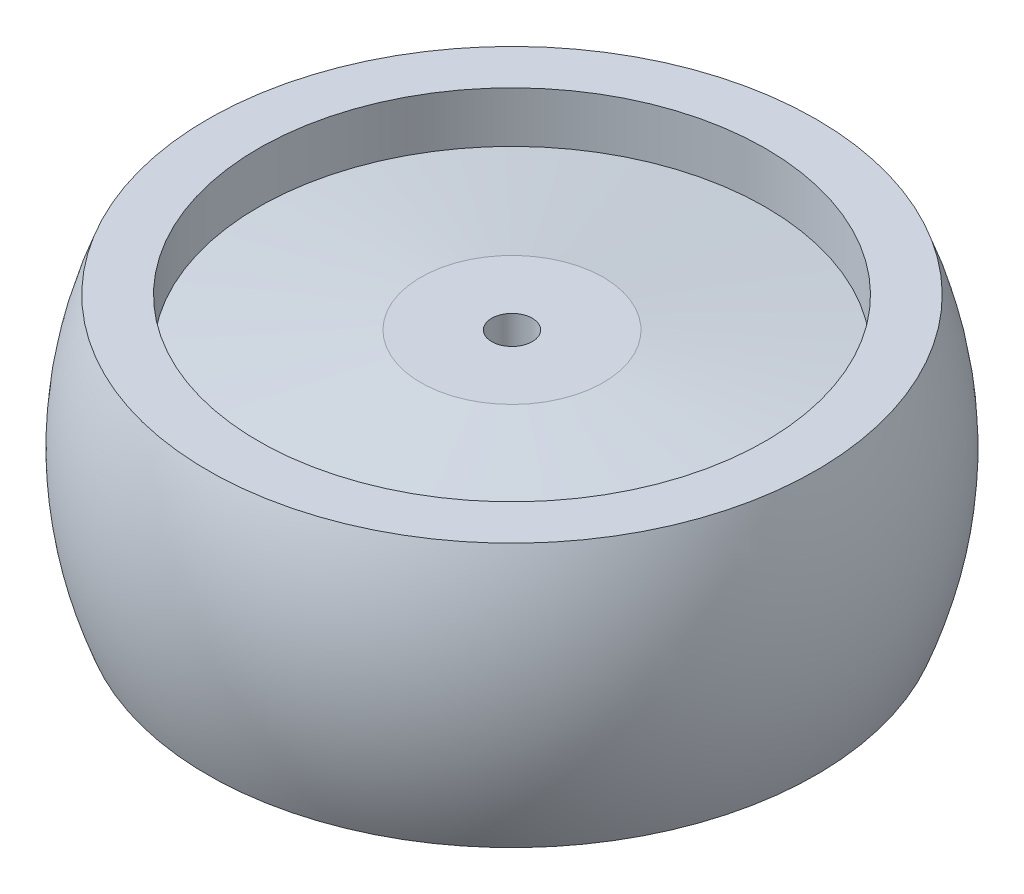
ISO-10303-21;
HEADER;
FILE_DESCRIPTION(('STEP AP214'),'2;1');
FILE_NAME('part.step','',(''),(''),'','','');
FILE_SCHEMA(('AUTOMOTIVE_DESIGN { 1 0 10303 214 1 1 1 1 }'));
ENDSEC;
DATA;
#1=APPLICATION_CONTEXT('core data for automotive mechanical design processes');
#2=APPLICATION_PROTOCOL_DEFINITION('international standard','automotive_design',2000,#1);
#3=PRODUCT_CONTEXT('',#1,'mechanical');
#4=PRODUCT('Part','Part','',(#3));
#5=PRODUCT_RELATED_PRODUCT_CATEGORY('part','',(#4));
#6=PRODUCT_DEFINITION_FORMATION('','',#4);
#7=PRODUCT_DEFINITION_CONTEXT('part definition',#1,'design');
#8=PRODUCT_DEFINITION('design','',#6,#7);
#9=PRODUCT_DEFINITION_SHAPE('','',#8);
#10=(LENGTH_UNIT() NAMED_UNIT(*) SI_UNIT(.MILLI.,.METRE.));
#11=(NAMED_UNIT(*) PLANE_ANGLE_UNIT() SI_UNIT($,.RADIAN.));
#12=(NAMED_UNIT(*) SI_UNIT($,.STERADIAN.) SOLID_ANGLE_UNIT());
#13=UNCERTAINTY_MEASURE_WITH_UNIT(LENGTH_MEASURE(1.E-05),#10,'distance_accuracy_value','');
#14=(GEOMETRIC_REPRESENTATION_CONTEXT(3) GLOBAL_UNCERTAINTY_ASSIGNED_CONTEXT((#13)) GLOBAL_UNIT_ASSIGNED_CONTEXT((#10,
#11,#12)) REPRESENTATION_CONTEXT('',''));
#15=CARTESIAN_POINT('',(0.,0.,0.));
#16=DIRECTION('',(0.,0.,1.));
#17=DIRECTION('',(1.,0.,0.));
#18=AXIS2_PLACEMENT_3D('',#15,#16,#17);
#19=CARTESIAN_POINT('',(-30.,13.,0.));
#20=CARTESIAN_POINT('',(-35.,0.,0.));
#21=CARTESIAN_POINT('',(-30.,-13.,0.));
#22=B_SPLINE_CURVE_WITH_KNOTS('',2,(#19,#20,#21),.UNSPECIFIED.,.F.,.F.,(3,3),(0.,1.),.UNSPECIFIED.);
#23=CARTESIAN_POINT('',(0.,-13.,0.));
#24=DIRECTION('',(0.,-1.,0.));
#25=AXIS1_PLACEMENT('',#23,#24);
#26=SURFACE_OF_REVOLUTION('',#22,#25);
#27=CARTESIAN_POINT('',(0.,-13.,0.));
#28=DIRECTION('',(0.,-1.,0.));
#29=DIRECTION('',(0.,0.,-1.));
#30=AXIS2_PLACEMENT_3D('',#27,#28,#29);
#31=CIRCLE('',#30,30.);
#32=CARTESIAN_POINT('',(0.,-13.,-30.));
#33=VERTEX_POINT('',#32);
#34=EDGE_CURVE('E53',#33,#33,#31,.T.);
#35=ORIENTED_EDGE('',*,*,#34,.F.);
#36=EDGE_LOOP('',(#35));
#37=FACE_BOUND('',#36,.T.);
#38=CARTESIAN_POINT('',(0.,13.,0.));
#39=DIRECTION('',(0.,-1.,0.));
#40=DIRECTION('',(0.,0.,-1.));
#41=AXIS2_PLACEMENT_3D('',#38,#39,#40);
#42=CIRCLE('',#41,30.);
#43=CARTESIAN_POINT('',(0.,13.,-30.));
#44=VERTEX_POINT('',#43);
#45=EDGE_CURVE('E172',#44,#44,#42,.T.);
#46=ORIENTED_EDGE('',*,*,#45,.T.);
#47=EDGE_LOOP('',(#46));
#48=FACE_BOUND('',#47,.T.);
#49=ADVANCED_FACE('F43',(#37,#48),#26,.T.);
#50=CARTESIAN_POINT('',(0.,-13.,0.));
#51=DIRECTION('',(0.,-1.,0.));
#52=DIRECTION('',(0.,0.,-1.));
#53=AXIS2_PLACEMENT_3D('',#50,#51,#52);
#54=PLANE('',#53);
#55=ORIENTED_EDGE('',*,*,#34,.T.);
#56=EDGE_LOOP('',(#55));
#57=FACE_BOUND('',#56,.T.);
#58=CARTESIAN_POINT('',(0.,-13.,0.));
#59=DIRECTION('',(0.,-1.,0.));
#60=DIRECTION('',(0.,0.,-1.));
#61=AXIS2_PLACEMENT_3D('',#58,#59,#60);
#62=CIRCLE('',#61,25.);
#63=CARTESIAN_POINT('',(0.,-13.,-25.));
#64=VERTEX_POINT('',#63);
#65=EDGE_CURVE('E207',#64,#64,#62,.T.);
#66=ORIENTED_EDGE('',*,*,#65,.F.);
#67=EDGE_LOOP('',(#66));
#68=FACE_BOUND('',#67,.T.);
#69=ADVANCED_FACE('F214',(#57,#68),#54,.T.);
#70=CARTESIAN_POINT('',(0.,-13.,0.));
#71=DIRECTION('',(0.,-1.,0.));
#72=DIRECTION('',(0.,0.,-1.));
#73=AXIS2_PLACEMENT_3D('',#70,#71,#72);
#74=CYLINDRICAL_SURFACE('',#73,25.);
#75=ORIENTED_EDGE('',*,*,#65,.T.);
#76=EDGE_LOOP('',(#75));
#77=FACE_BOUND('',#76,.T.);
#78=CARTESIAN_POINT('',(0.,3.96887112585072,0.));
#79=DIRECTION('',(0.,-1.,0.));
#80=DIRECTION('',(0.,0.,-1.));
#81=AXIS2_PLACEMENT_3D('',#78,#79,#80);
#82=CIRCLE('',#81,25.);
#83=CARTESIAN_POINT('',(0.,3.96887112585072,-25.));
#84=VERTEX_POINT('',#83);
#85=EDGE_CURVE('E203',#84,#84,#82,.T.);
#86=ORIENTED_EDGE('',*,*,#85,.F.);
#87=EDGE_LOOP('',(#86));
#88=FACE_BOUND('',#87,.T.);
#89=ADVANCED_FACE('F233',(#77,#88),#74,.F.);
#90=CARTESIAN_POINT('',(0.,3.96887112585072,0.));
#91=DIRECTION('',(0.,-1.,0.));
#92=DIRECTION('',(0.,0.,-1.));
#93=AXIS2_PLACEMENT_3D('',#90,#91,#92);
#94=CONICAL_SURFACE('',#93,25.,1.44644133224814);
#95=CARTESIAN_POINT('',(0.,5.96887112585072,0.));
#96=DIRECTION('',(0.,-1.,0.));
#97=DIRECTION('',(0.,0.,-1.));
#98=AXIS2_PLACEMENT_3D('',#95,#96,#97);
#99=CIRCLE('',#98,9.);
#100=CARTESIAN_POINT('',(0.,5.96887112585072,-9.));
#101=VERTEX_POINT('',#100);
#102=EDGE_CURVE('E199',#101,#101,#99,.T.);
#103=ORIENTED_EDGE('',*,*,#102,.F.);
#104=EDGE_LOOP('',(#103));
#105=FACE_BOUND('',#104,.T.);
#106=ORIENTED_EDGE('',*,*,#85,.T.);
#107=EDGE_LOOP('',(#106));
#108=FACE_BOUND('',#107,.T.);
#109=ADVANCED_FACE('F241',(#105,#108),#94,.F.);
#110=CARTESIAN_POINT('',(0.,-13.,0.));
#111=DIRECTION('',(0.,-1.,0.));
#112=DIRECTION('',(0.,0.,-1.));
#113=AXIS2_PLACEMENT_3D('',#110,#111,#112);
#114=CYLINDRICAL_SURFACE('',#113,9.);
#115=CARTESIAN_POINT('',(0.,5.,0.));
#116=DIRECTION('',(0.,-1.,0.));
#117=DIRECTION('',(0.,0.,-1.));
#118=AXIS2_PLACEMENT_3D('',#115,#116,#117);
#119=CIRCLE('',#118,9.);
#120=CARTESIAN_POINT('',(0.,5.,-9.));
#121=VERTEX_POINT('',#120);
#122=EDGE_CURVE('E195',#121,#121,#119,.T.);
#123=ORIENTED_EDGE('',*,*,#122,.F.);
#124=EDGE_LOOP('',(#123));
#125=FACE_BOUND('',#124,.T.);
#126=ORIENTED_EDGE('',*,*,#102,.T.);
#127=EDGE_LOOP('',(#126));
#128=FACE_BOUND('',#127,.T.);
#129=ADVANCED_FACE('F247',(#125,#128),#114,.T.);
#130=CARTESIAN_POINT('',(0.,5.,0.));
#131=DIRECTION('',(0.,-1.,0.));
#132=DIRECTION('',(0.,0.,-1.));
#133=AXIS2_PLACEMENT_3D('',#130,#131,#132);
#134=PLANE('',#133);
#135=CARTESIAN_POINT('',(0.,5.,0.));
#136=DIRECTION('',(0.,-1.,0.));
#137=DIRECTION('',(0.,0.,-1.));
#138=AXIS2_PLACEMENT_3D('',#135,#136,#137);
#139=CIRCLE('',#138,8.);
#140=CARTESIAN_POINT('',(0.,5.,-8.));
#141=VERTEX_POINT('',#140);
#142=EDGE_CURVE('E11',#141,#141,#139,.T.);
#143=ORIENTED_EDGE('',*,*,#142,.F.);
#144=EDGE_LOOP('',(#143));
#145=FACE_BOUND('',#144,.T.);
#146=ORIENTED_EDGE('',*,*,#122,.T.);
#147=EDGE_LOOP('',(#146));
#148=FACE_BOUND('',#147,.T.);
#149=ADVANCED_FACE('F259',(#145,#148),#134,.T.);
#150=CARTESIAN_POINT('',(0.,10.,0.));
#151=DIRECTION('',(0.,-1.,0.));
#152=DIRECTION('',(0.,0.,-1.));
#153=AXIS2_PLACEMENT_3D('',#150,#151,#152);
#154=PLANE('',#153);
#155=CARTESIAN_POINT('',(0.,10.,0.));
#156=DIRECTION('',(0.,-1.,0.));
#157=DIRECTION('',(0.,0.,-1.));
#158=AXIS2_PLACEMENT_3D('',#155,#156,#157);
#159=CIRCLE('',#158,2.);
#160=CARTESIAN_POINT('',(0.,10.,-2.));
#161=VERTEX_POINT('',#160);
#162=EDGE_CURVE('E47',#161,#161,#159,.T.);
#163=ORIENTED_EDGE('',*,*,#162,.T.);
#164=EDGE_LOOP('',(#163));
#165=FACE_BOUND('',#164,.T.);
#166=CARTESIAN_POINT('',(0.,10.,0.));
#167=DIRECTION('',(0.,-1.,0.));
#168=DIRECTION('',(0.,0.,-1.));
#169=AXIS2_PLACEMENT_3D('',#166,#167,#168);
#170=CIRCLE('',#169,9.);
#171=CARTESIAN_POINT('',(0.,10.,-9.));
#172=VERTEX_POINT('',#171);
#173=EDGE_CURVE('E191',#172,#172,#170,.T.);
#174=ORIENTED_EDGE('',*,*,#173,.F.);
#175=EDGE_LOOP('',(#174));
#176=FACE_BOUND('',#175,.T.);
#177=ADVANCED_FACE('F237',(#165,#176),#154,.F.);
#178=CARTESIAN_POINT('',(0.,8.,0.));
#179=DIRECTION('',(0.,-1.,0.));
#180=DIRECTION('',(0.,0.,-1.));
#181=AXIS2_PLACEMENT_3D('',#178,#179,#180);
#182=CONICAL_SURFACE('',#181,25.,1.44644133224814);
#183=ORIENTED_EDGE('',*,*,#173,.T.);
#184=EDGE_LOOP('',(#183));
#185=FACE_BOUND('',#184,.T.);
#186=CARTESIAN_POINT('',(0.,8.,0.));
#187=DIRECTION('',(0.,-1.,0.));
#188=DIRECTION('',(0.,0.,-1.));
#189=AXIS2_PLACEMENT_3D('',#186,#187,#188);
#190=CIRCLE('',#189,25.);
#191=CARTESIAN_POINT('',(0.,8.,-25.));
#192=VERTEX_POINT('',#191);
#193=EDGE_CURVE('E187',#192,#192,#190,.T.);
#194=ORIENTED_EDGE('',*,*,#193,.F.);
#195=EDGE_LOOP('',(#194));
#196=FACE_BOUND('',#195,.T.);
#197=ADVANCED_FACE('F230',(#185,#196),#182,.T.);
#198=ORIENTED_EDGE('',*,*,#193,.T.);
#199=EDGE_LOOP('',(#198));
#200=FACE_BOUND('',#199,.T.);
#201=CARTESIAN_POINT('',(0.,13.,0.));
#202=DIRECTION('',(0.,-1.,0.));
#203=DIRECTION('',(0.,0.,-1.));
#204=AXIS2_PLACEMENT_3D('',#201,#202,#203);
#205=CIRCLE('',#204,25.);
#206=CARTESIAN_POINT('',(0.,13.,-25.));
#207=VERTEX_POINT('',#206);
#208=EDGE_CURVE('E183',#207,#207,#205,.T.);
#209=ORIENTED_EDGE('',*,*,#208,.F.);
#210=EDGE_LOOP('',(#209));
#211=FACE_BOUND('',#210,.T.);
#212=ADVANCED_FACE('F225',(#200,#211),#74,.F.);
#213=CARTESIAN_POINT('',(0.,13.,0.));
#214=DIRECTION('',(0.,-1.,0.));
#215=DIRECTION('',(0.,0.,-1.));
#216=AXIS2_PLACEMENT_3D('',#213,#214,#215);
#217=PLANE('',#216);
#218=ORIENTED_EDGE('',*,*,#45,.F.);
#219=EDGE_LOOP('',(#218));
#220=FACE_BOUND('',#219,.T.);
#221=ORIENTED_EDGE('',*,*,#208,.T.);
#222=EDGE_LOOP('',(#221));
#223=FACE_BOUND('',#222,.T.);
#224=ADVANCED_FACE('F221',(#220,#223),#217,.F.);
#225=CARTESIAN_POINT('',(0.,-1.,0.));
#226=DIRECTION('',(0.,1.,0.));
#227=DIRECTION('',(0.,0.,1.));
#228=AXIS2_PLACEMENT_3D('',#225,#226,#227);
#229=CYLINDRICAL_SURFACE('',#228,8.);
#230=CARTESIAN_POINT('',(0.,-1.,0.));
#231=DIRECTION('',(0.,-1.,0.));
#232=DIRECTION('',(0.,0.,-1.));
#233=AXIS2_PLACEMENT_3D('',#230,#231,#232);
#234=CIRCLE('',#233,8.);
#235=CARTESIAN_POINT('',(0.,-1.,-8.));
#236=VERTEX_POINT('',#235);
#237=EDGE_CURVE('E160',#236,#236,#234,.T.);
#238=ORIENTED_EDGE('',*,*,#237,.F.);
#239=EDGE_LOOP('',(#238));
#240=FACE_BOUND('',#239,.T.);
#241=ORIENTED_EDGE('',*,*,#142,.T.);
#242=EDGE_LOOP('',(#241));
#243=FACE_BOUND('',#242,.T.);
#244=ADVANCED_FACE('F224',(#240,#243),#229,.T.);
#245=CARTESIAN_POINT('',(0.,-1.,0.));
#246=DIRECTION('',(0.,-1.,0.));
#247=DIRECTION('',(0.,0.,-1.));
#248=AXIS2_PLACEMENT_3D('',#245,#246,#247);
#249=PLANE('',#248);
#250=DIRECTION('',(0.5,0.,0.866025403784439));
#251=VECTOR('',#250,1.);
#252=CARTESIAN_POINT('',(3.46410161513775,-1.,-6.));
#253=LINE('',#252,#251);
#254=CARTESIAN_POINT('',(3.46410161513775,-1.,-6.));
#255=VERTEX_POINT('',#254);
#256=CARTESIAN_POINT('',(6.92820323027551,-1.,0.));
#257=VERTEX_POINT('',#256);
#258=EDGE_CURVE('E61',#255,#257,#253,.T.);
#259=ORIENTED_EDGE('',*,*,#258,.F.);
#260=DIRECTION('',(1.,0.,0.));
#261=VECTOR('',#260,1.);
#262=CARTESIAN_POINT('',(-3.46410161513776,-1.,-6.));
#263=LINE('',#262,#261);
#264=CARTESIAN_POINT('',(-3.46410161513776,-1.,-6.));
#265=VERTEX_POINT('',#264);
#266=EDGE_CURVE('E154',#265,#255,#263,.T.);
#267=ORIENTED_EDGE('',*,*,#266,.F.);
#268=DIRECTION('',(0.5,0.,-0.866025403784439));
#269=VECTOR('',#268,1.);
#270=CARTESIAN_POINT('',(-6.92820323027551,-1.,0.));
#271=LINE('',#270,#269);
#272=CARTESIAN_POINT('',(-6.92820323027551,-1.,0.));
#273=VERTEX_POINT('',#272);
#274=EDGE_CURVE('E151',#273,#265,#271,.T.);
#275=ORIENTED_EDGE('',*,*,#274,.F.);
#276=DIRECTION('',(-0.5,0.,-0.866025403784439));
#277=VECTOR('',#276,1.);
#278=CARTESIAN_POINT('',(-3.46410161513775,-1.,6.));
#279=LINE('',#278,#277);
#280=CARTESIAN_POINT('',(-3.46410161513775,-1.,6.));
#281=VERTEX_POINT('',#280);
#282=EDGE_CURVE('E109',#281,#273,#279,.T.);
#283=ORIENTED_EDGE('',*,*,#282,.F.);
#284=DIRECTION('',(-1.,0.,0.));
#285=VECTOR('',#284,1.);
#286=CARTESIAN_POINT('',(3.46410161513775,-1.,6.));
#287=LINE('',#286,#285);
#288=CARTESIAN_POINT('',(3.46410161513775,-1.,6.));
#289=VERTEX_POINT('',#288);
#290=EDGE_CURVE('E145',#289,#281,#287,.T.);
#291=ORIENTED_EDGE('',*,*,#290,.F.);
#292=DIRECTION('',(-0.5,0.,0.866025403784439));
#293=VECTOR('',#292,1.);
#294=CARTESIAN_POINT('',(6.92820323027551,-1.,0.));
#295=LINE('',#294,#293);
#296=EDGE_CURVE('E141',#257,#289,#295,.T.);
#297=ORIENTED_EDGE('',*,*,#296,.F.);
#298=EDGE_LOOP('',(#259,#267,#275,#283,#291,#297));
#299=FACE_BOUND('',#298,.T.);
#300=ORIENTED_EDGE('',*,*,#237,.T.);
#301=EDGE_LOOP('',(#300));
#302=FACE_BOUND('',#301,.T.);
#303=ADVANCED_FACE('F292',(#299,#302),#249,.T.);
#304=CARTESIAN_POINT('',(3.46410161513775,4.,-6.));
#305=DIRECTION('',(0.866025403784439,0.,-0.5));
#306=DIRECTION('',(-0.5,0.,-0.866025403784439));
#307=AXIS2_PLACEMENT_3D('',#304,#305,#306);
#308=PLANE('',#307);
#309=ORIENTED_EDGE('',*,*,#258,.T.);
#310=DIRECTION('',(0.,-1.,0.));
#311=VECTOR('',#310,1.);
#312=CARTESIAN_POINT('',(6.92820323027551,4.,0.));
#313=LINE('',#312,#311);
#314=CARTESIAN_POINT('',(6.92820323027551,4.,0.));
#315=VERTEX_POINT('',#314);
#316=EDGE_CURVE('E91',#315,#257,#313,.T.);
#317=ORIENTED_EDGE('',*,*,#316,.F.);
#318=DIRECTION('',(0.5,0.,0.866025403784439));
#319=VECTOR('',#318,1.);
#320=CARTESIAN_POINT('',(3.46410161513775,4.,-6.));
#321=LINE('',#320,#319);
#322=CARTESIAN_POINT('',(3.46410161513775,4.,-6.));
#323=VERTEX_POINT('',#322);
#324=EDGE_CURVE('E157',#323,#315,#321,.T.);
#325=ORIENTED_EDGE('',*,*,#324,.F.);
#326=DIRECTION('',(0.,-1.,0.));
#327=VECTOR('',#326,1.);
#328=CARTESIAN_POINT('',(3.46410161513775,4.,-6.));
#329=LINE('',#328,#327);
#330=EDGE_CURVE('E69',#323,#255,#329,.T.);
#331=ORIENTED_EDGE('',*,*,#330,.T.);
#332=EDGE_LOOP('',(#309,#317,#325,#331));
#333=FACE_BOUND('',#332,.T.);
#334=ADVANCED_FACE('F297',(#333),#308,.F.);
#335=CARTESIAN_POINT('',(-3.46410161513776,4.,-6.));
#336=DIRECTION('',(0.,0.,-1.));
#337=DIRECTION('',(-1.,0.,0.));
#338=AXIS2_PLACEMENT_3D('',#335,#336,#337);
#339=PLANE('',#338);
#340=ORIENTED_EDGE('',*,*,#266,.T.);
#341=ORIENTED_EDGE('',*,*,#330,.F.);
#342=DIRECTION('',(1.,0.,0.));
#343=VECTOR('',#342,1.);
#344=CARTESIAN_POINT('',(-3.46410161513776,4.,-6.));
#345=LINE('',#344,#343);
#346=CARTESIAN_POINT('',(-3.46410161513776,4.,-6.));
#347=VERTEX_POINT('',#346);
#348=EDGE_CURVE('E123',#347,#323,#345,.T.);
#349=ORIENTED_EDGE('',*,*,#348,.F.);
#350=DIRECTION('',(0.,-1.,0.));
#351=VECTOR('',#350,1.);
#352=CARTESIAN_POINT('',(-3.46410161513776,4.,-6.));
#353=LINE('',#352,#351);
#354=EDGE_CURVE('E114',#347,#265,#353,.T.);
#355=ORIENTED_EDGE('',*,*,#354,.T.);
#356=EDGE_LOOP('',(#340,#341,#349,#355));
#357=FACE_BOUND('',#356,.T.);
#358=ADVANCED_FACE('F295',(#357),#339,.F.);
#359=CARTESIAN_POINT('',(-6.92820323027551,4.,0.));
#360=DIRECTION('',(-0.866025403784439,0.,-0.5));
#361=DIRECTION('',(-0.5,0.,0.866025403784439));
#362=AXIS2_PLACEMENT_3D('',#359,#360,#361);
#363=PLANE('',#362);
#364=ORIENTED_EDGE('',*,*,#274,.T.);
#365=ORIENTED_EDGE('',*,*,#354,.F.);
#366=DIRECTION('',(0.5,0.,-0.866025403784439));
#367=VECTOR('',#366,1.);
#368=CARTESIAN_POINT('',(-6.92820323027551,4.,0.));
#369=LINE('',#368,#367);
#370=CARTESIAN_POINT('',(-6.92820323027551,4.,0.));
#371=VERTEX_POINT('',#370);
#372=EDGE_CURVE('E118',#371,#347,#369,.T.);
#373=ORIENTED_EDGE('',*,*,#372,.F.);
#374=DIRECTION('',(0.,-1.,0.));
#375=VECTOR('',#374,1.);
#376=CARTESIAN_POINT('',(-6.92820323027551,4.,0.));
#377=LINE('',#376,#375);
#378=EDGE_CURVE('E102',#371,#273,#377,.T.);
#379=ORIENTED_EDGE('',*,*,#378,.T.);
#380=EDGE_LOOP('',(#364,#365,#373,#379));
#381=FACE_BOUND('',#380,.T.);
#382=ADVANCED_FACE('F119',(#381),#363,.F.);
#383=CARTESIAN_POINT('',(-3.46410161513775,4.,6.));
#384=DIRECTION('',(-0.866025403784439,0.,0.5));
#385=DIRECTION('',(0.5,0.,0.866025403784439));
#386=AXIS2_PLACEMENT_3D('',#383,#384,#385);
#387=PLANE('',#386);
#388=ORIENTED_EDGE('',*,*,#282,.T.);
#389=ORIENTED_EDGE('',*,*,#378,.F.);
#390=DIRECTION('',(-0.5,0.,-0.866025403784439));
#391=VECTOR('',#390,1.);
#392=CARTESIAN_POINT('',(-3.46410161513775,4.,6.));
#393=LINE('',#392,#391);
#394=CARTESIAN_POINT('',(-3.46410161513775,4.,6.));
#395=VERTEX_POINT('',#394);
#396=EDGE_CURVE('E106',#395,#371,#393,.T.);
#397=ORIENTED_EDGE('',*,*,#396,.F.);
#398=DIRECTION('',(0.,-1.,0.));
#399=VECTOR('',#398,1.);
#400=CARTESIAN_POINT('',(-3.46410161513775,4.,6.));
#401=LINE('',#400,#399);
#402=EDGE_CURVE('E115',#395,#281,#401,.T.);
#403=ORIENTED_EDGE('',*,*,#402,.T.);
#404=EDGE_LOOP('',(#388,#389,#397,#403));
#405=FACE_BOUND('',#404,.T.);
#406=ADVANCED_FACE('F104',(#405),#387,.F.);
#407=CARTESIAN_POINT('',(3.46410161513775,4.,6.));
#408=DIRECTION('',(0.,0.,1.));
#409=DIRECTION('',(1.,0.,0.));
#410=AXIS2_PLACEMENT_3D('',#407,#408,#409);
#411=PLANE('',#410);
#412=ORIENTED_EDGE('',*,*,#290,.T.);
#413=ORIENTED_EDGE('',*,*,#402,.F.);
#414=DIRECTION('',(-1.,0.,0.));
#415=VECTOR('',#414,1.);
#416=CARTESIAN_POINT('',(3.46410161513775,4.,6.));
#417=LINE('',#416,#415);
#418=CARTESIAN_POINT('',(3.46410161513775,4.,6.));
#419=VERTEX_POINT('',#418);
#420=EDGE_CURVE('E129',#419,#395,#417,.T.);
#421=ORIENTED_EDGE('',*,*,#420,.F.);
#422=DIRECTION('',(0.,-1.,0.));
#423=VECTOR('',#422,1.);
#424=CARTESIAN_POINT('',(3.46410161513775,4.,6.));
#425=LINE('',#424,#423);
#426=EDGE_CURVE('E165',#419,#289,#425,.T.);
#427=ORIENTED_EDGE('',*,*,#426,.T.);
#428=EDGE_LOOP('',(#412,#413,#421,#427));
#429=FACE_BOUND('',#428,.T.);
#430=ADVANCED_FACE('F290',(#429),#411,.F.);
#431=CARTESIAN_POINT('',(6.92820323027551,4.,0.));
#432=DIRECTION('',(0.866025403784439,0.,0.5));
#433=DIRECTION('',(0.5,0.,-0.866025403784439));
#434=AXIS2_PLACEMENT_3D('',#431,#432,#433);
#435=PLANE('',#434);
#436=ORIENTED_EDGE('',*,*,#296,.T.);
#437=ORIENTED_EDGE('',*,*,#426,.F.);
#438=DIRECTION('',(-0.5,0.,0.866025403784439));
#439=VECTOR('',#438,1.);
#440=CARTESIAN_POINT('',(6.92820323027551,4.,0.));
#441=LINE('',#440,#439);
#442=EDGE_CURVE('E133',#315,#419,#441,.T.);
#443=ORIENTED_EDGE('',*,*,#442,.F.);
#444=ORIENTED_EDGE('',*,*,#316,.T.);
#445=EDGE_LOOP('',(#436,#437,#443,#444));
#446=FACE_BOUND('',#445,.T.);
#447=ADVANCED_FACE('F286',(#446),#435,.F.);
#448=CARTESIAN_POINT('',(0.,4.,0.));
#449=DIRECTION('',(0.,-1.,0.));
#450=DIRECTION('',(0.,0.,-1.));
#451=AXIS2_PLACEMENT_3D('',#448,#449,#450);
#452=PLANE('',#451);
#453=CARTESIAN_POINT('',(0.,4.,0.));
#454=DIRECTION('',(0.,-1.,0.));
#455=DIRECTION('',(0.,0.,-1.));
#456=AXIS2_PLACEMENT_3D('',#453,#454,#455);
#457=CIRCLE('',#456,2.);
#458=CARTESIAN_POINT('',(0.,4.,-2.));
#459=VERTEX_POINT('',#458);
#460=EDGE_CURVE('E276',#459,#459,#457,.T.);
#461=ORIENTED_EDGE('',*,*,#460,.F.);
#462=EDGE_LOOP('',(#461));
#463=FACE_BOUND('',#462,.T.);
#464=ORIENTED_EDGE('',*,*,#324,.T.);
#465=ORIENTED_EDGE('',*,*,#442,.T.);
#466=ORIENTED_EDGE('',*,*,#420,.T.);
#467=ORIENTED_EDGE('',*,*,#396,.T.);
#468=ORIENTED_EDGE('',*,*,#372,.T.);
#469=ORIENTED_EDGE('',*,*,#348,.T.);
#470=EDGE_LOOP('',(#464,#465,#466,#467,#468,#469));
#471=FACE_BOUND('',#470,.T.);
#472=ADVANCED_FACE('F126',(#463,#471),#452,.T.);
#473=CARTESIAN_POINT('',(0.,13.,0.));
#474=DIRECTION('',(0.,-1.,0.));
#475=DIRECTION('',(0.,0.,-1.));
#476=AXIS2_PLACEMENT_3D('',#473,#474,#475);
#477=CYLINDRICAL_SURFACE('',#476,2.);
#478=ORIENTED_EDGE('',*,*,#460,.T.);
#479=EDGE_LOOP('',(#478));
#480=FACE_BOUND('',#479,.T.);
#481=ORIENTED_EDGE('',*,*,#162,.F.);
#482=EDGE_LOOP('',(#481));
#483=FACE_BOUND('',#482,.T.);
#484=ADVANCED_FACE('F381',(#480,#483),#477,.F.);
#485=CLOSED_SHELL('',(#49,#69,#89,#109,#129,#149,#177,#197,#212,#224,#244,#303,#334,#358,#382,
#406,#430,#447,#472,#484));
#486=MANIFOLD_SOLID_BREP('B2',#485);
#487=ADVANCED_BREP_SHAPE_REPRESENTATION('',(#18,#486),#14);
#488=SHAPE_DEFINITION_REPRESENTATION(#9,#487);
ENDSEC;
END-ISO-10303-21;
